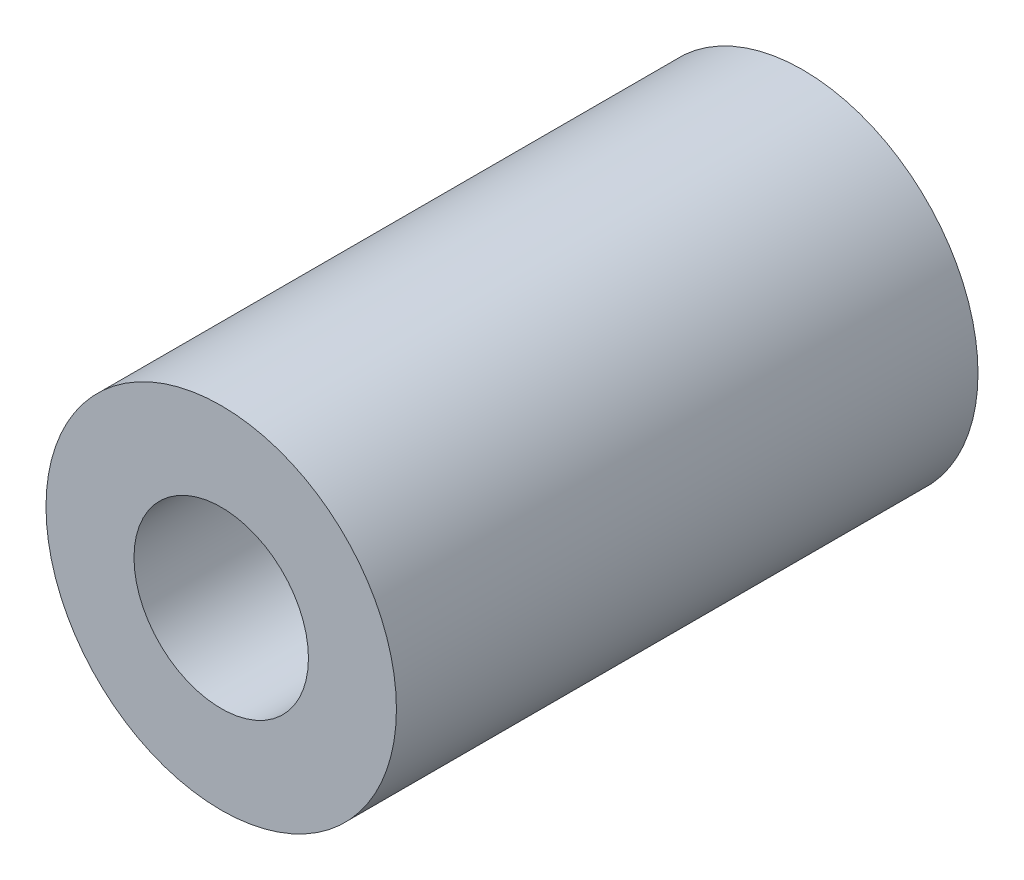
ISO-10303-21;
HEADER;
FILE_DESCRIPTION(('STEP AP214'),'2;1');
FILE_NAME('part.step','',(''),(''),'','','');
FILE_SCHEMA(('AUTOMOTIVE_DESIGN { 1 0 10303 214 1 1 1 1 }'));
ENDSEC;
DATA;
#1=APPLICATION_CONTEXT('core data for automotive mechanical design processes');
#2=APPLICATION_PROTOCOL_DEFINITION('international standard','automotive_design',2000,#1);
#3=PRODUCT_CONTEXT('',#1,'mechanical');
#4=PRODUCT('Part','Part','',(#3));
#5=PRODUCT_RELATED_PRODUCT_CATEGORY('part','',(#4));
#6=PRODUCT_DEFINITION_FORMATION('','',#4);
#7=PRODUCT_DEFINITION_CONTEXT('part definition',#1,'design');
#8=PRODUCT_DEFINITION('design','',#6,#7);
#9=PRODUCT_DEFINITION_SHAPE('','',#8);
#10=(LENGTH_UNIT() NAMED_UNIT(*) SI_UNIT(.MILLI.,.METRE.));
#11=(NAMED_UNIT(*) PLANE_ANGLE_UNIT() SI_UNIT($,.RADIAN.));
#12=(NAMED_UNIT(*) SI_UNIT($,.STERADIAN.) SOLID_ANGLE_UNIT());
#13=UNCERTAINTY_MEASURE_WITH_UNIT(LENGTH_MEASURE(1.E-05),#10,'distance_accuracy_value','');
#14=(GEOMETRIC_REPRESENTATION_CONTEXT(3) GLOBAL_UNCERTAINTY_ASSIGNED_CONTEXT((#13)) GLOBAL_UNIT_ASSIGNED_CONTEXT((#10,
#11,#12)) REPRESENTATION_CONTEXT('',''));
#15=CARTESIAN_POINT('',(0.,0.,0.));
#16=DIRECTION('',(0.,0.,1.));
#17=DIRECTION('',(1.,0.,0.));
#18=AXIS2_PLACEMENT_3D('',#15,#16,#17);
#19=CARTESIAN_POINT('',(0.,0.,10.));
#20=DIRECTION('',(0.,0.,1.));
#21=DIRECTION('',(1.,0.,0.));
#22=AXIS2_PLACEMENT_3D('',#19,#20,#21);
#23=PLANE('',#22);
#24=CARTESIAN_POINT('',(0.,0.,10.));
#25=DIRECTION('',(0.,0.,1.));
#26=DIRECTION('',(1.,0.,0.));
#27=AXIS2_PLACEMENT_3D('',#24,#25,#26);
#28=CIRCLE('',#27,6.0255);
#29=CARTESIAN_POINT('',(6.0255,0.,10.));
#30=VERTEX_POINT('',#29);
#31=EDGE_CURVE('E10',#30,#30,#28,.T.);
#32=ORIENTED_EDGE('',*,*,#31,.T.);
#33=EDGE_LOOP('',(#32));
#34=FACE_BOUND('',#33,.T.);
#35=CARTESIAN_POINT('',(0.,0.,10.));
#36=DIRECTION('',(0.,0.,1.));
#37=DIRECTION('',(1.,0.,0.));
#38=AXIS2_PLACEMENT_3D('',#35,#36,#37);
#39=CIRCLE('',#38,3.);
#40=CARTESIAN_POINT('',(3.,0.,10.));
#41=VERTEX_POINT('',#40);
#42=EDGE_CURVE('E41',#41,#41,#39,.T.);
#43=ORIENTED_EDGE('',*,*,#42,.F.);
#44=EDGE_LOOP('',(#43));
#45=FACE_BOUND('',#44,.T.);
#46=ADVANCED_FACE('F34',(#34,#45),#23,.T.);
#47=CARTESIAN_POINT('',(0.,0.,10.));
#48=DIRECTION('',(0.,0.,-1.));
#49=DIRECTION('',(-1.,0.,0.));
#50=AXIS2_PLACEMENT_3D('',#47,#48,#49);
#51=CYLINDRICAL_SURFACE('',#50,6.0255);
#52=ORIENTED_EDGE('',*,*,#31,.F.);
#53=EDGE_LOOP('',(#52));
#54=FACE_BOUND('',#53,.T.);
#55=CARTESIAN_POINT('',(0.,0.,-10.));
#56=DIRECTION('',(0.,0.,1.));
#57=DIRECTION('',(1.,0.,0.));
#58=AXIS2_PLACEMENT_3D('',#55,#56,#57);
#59=CIRCLE('',#58,6.0255);
#60=CARTESIAN_POINT('',(6.0255,0.,-10.));
#61=VERTEX_POINT('',#60);
#62=EDGE_CURVE('E45',#61,#61,#59,.T.);
#63=ORIENTED_EDGE('',*,*,#62,.T.);
#64=EDGE_LOOP('',(#63));
#65=FACE_BOUND('',#64,.T.);
#66=ADVANCED_FACE('F36',(#54,#65),#51,.T.);
#67=CARTESIAN_POINT('',(0.,0.,10.));
#68=DIRECTION('',(0.,0.,-1.));
#69=DIRECTION('',(-1.,0.,0.));
#70=AXIS2_PLACEMENT_3D('',#67,#68,#69);
#71=CYLINDRICAL_SURFACE('',#70,3.);
#72=ORIENTED_EDGE('',*,*,#42,.T.);
#73=EDGE_LOOP('',(#72));
#74=FACE_BOUND('',#73,.T.);
#75=CARTESIAN_POINT('',(0.,0.,-10.));
#76=DIRECTION('',(0.,0.,1.));
#77=DIRECTION('',(1.,0.,0.));
#78=AXIS2_PLACEMENT_3D('',#75,#76,#77);
#79=CIRCLE('',#78,3.);
#80=CARTESIAN_POINT('',(3.,0.,-10.));
#81=VERTEX_POINT('',#80);
#82=EDGE_CURVE('E49',#81,#81,#79,.T.);
#83=ORIENTED_EDGE('',*,*,#82,.F.);
#84=EDGE_LOOP('',(#83));
#85=FACE_BOUND('',#84,.T.);
#86=ADVANCED_FACE('F58',(#74,#85),#71,.F.);
#87=CARTESIAN_POINT('',(0.,0.,-10.));
#88=DIRECTION('',(0.,0.,1.));
#89=DIRECTION('',(1.,0.,0.));
#90=AXIS2_PLACEMENT_3D('',#87,#88,#89);
#91=PLANE('',#90);
#92=ORIENTED_EDGE('',*,*,#82,.T.);
#93=EDGE_LOOP('',(#92));
#94=FACE_BOUND('',#93,.T.);
#95=ORIENTED_EDGE('',*,*,#62,.F.);
#96=EDGE_LOOP('',(#95));
#97=FACE_BOUND('',#96,.T.);
#98=ADVANCED_FACE('F55',(#94,#97),#91,.F.);
#99=CLOSED_SHELL('',(#46,#66,#86,#98));
#100=MANIFOLD_SOLID_BREP('B2',#99);
#101=ADVANCED_BREP_SHAPE_REPRESENTATION('',(#18,#100),#14);
#102=SHAPE_DEFINITION_REPRESENTATION(#9,#101);
ENDSEC;
END-ISO-10303-21;
